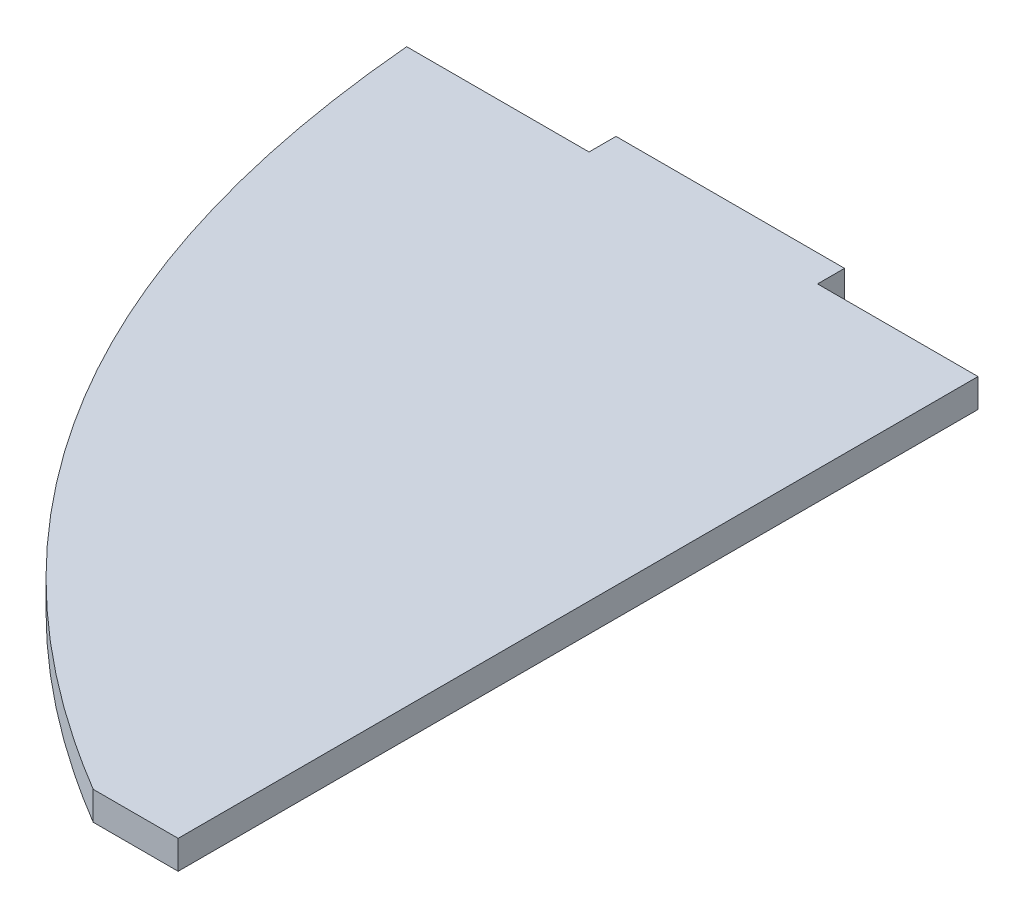
ISO-10303-21;
HEADER;
FILE_DESCRIPTION(('STEP AP214'),'2;1');
FILE_NAME('part.step','',(''),(''),'','','');
FILE_SCHEMA(('AUTOMOTIVE_DESIGN { 1 0 10303 214 1 1 1 1 }'));
ENDSEC;
DATA;
#1=APPLICATION_CONTEXT('core data for automotive mechanical design processes');
#2=APPLICATION_PROTOCOL_DEFINITION('international standard','automotive_design',2000,#1);
#3=PRODUCT_CONTEXT('',#1,'mechanical');
#4=PRODUCT('Part','Part','',(#3));
#5=PRODUCT_RELATED_PRODUCT_CATEGORY('part','',(#4));
#6=PRODUCT_DEFINITION_FORMATION('','',#4);
#7=PRODUCT_DEFINITION_CONTEXT('part definition',#1,'design');
#8=PRODUCT_DEFINITION('design','',#6,#7);
#9=PRODUCT_DEFINITION_SHAPE('','',#8);
#10=(LENGTH_UNIT() NAMED_UNIT(*) SI_UNIT(.MILLI.,.METRE.));
#11=(NAMED_UNIT(*) PLANE_ANGLE_UNIT() SI_UNIT($,.RADIAN.));
#12=(NAMED_UNIT(*) SI_UNIT($,.STERADIAN.) SOLID_ANGLE_UNIT());
#13=UNCERTAINTY_MEASURE_WITH_UNIT(LENGTH_MEASURE(1.E-05),#10,'distance_accuracy_value','');
#14=(GEOMETRIC_REPRESENTATION_CONTEXT(3) GLOBAL_UNCERTAINTY_ASSIGNED_CONTEXT((#13)) GLOBAL_UNIT_ASSIGNED_CONTEXT((#10,
#11,#12)) REPRESENTATION_CONTEXT('',''));
#15=CARTESIAN_POINT('',(0.,0.,0.));
#16=DIRECTION('',(0.,0.,1.));
#17=DIRECTION('',(1.,0.,0.));
#18=AXIS2_PLACEMENT_3D('',#15,#16,#17);
#19=CARTESIAN_POINT('',(36.7862068965517,-3.175,0.));
#20=DIRECTION('',(1.,0.,0.));
#21=DIRECTION('',(0.,0.,-1.));
#22=AXIS2_PLACEMENT_3D('',#19,#20,#21);
#23=PLANE('',#22);
#24=DIRECTION('',(0.,0.,-1.));
#25=VECTOR('',#24,1.);
#26=CARTESIAN_POINT('',(36.7862068965517,0.,0.));
#27=LINE('',#26,#25);
#28=CARTESIAN_POINT('',(36.7862068965517,0.,88.9));
#29=VERTEX_POINT('',#28);
#30=CARTESIAN_POINT('',(36.7862068965517,0.,0.));
#31=VERTEX_POINT('',#30);
#32=EDGE_CURVE('E167',#29,#31,#27,.T.);
#33=ORIENTED_EDGE('',*,*,#32,.F.);
#34=DIRECTION('',(0.,1.,0.));
#35=VECTOR('',#34,1.);
#36=CARTESIAN_POINT('',(36.7862068965517,-3.175,88.9));
#37=LINE('',#36,#35);
#38=CARTESIAN_POINT('',(36.7862068965517,-3.175,88.9));
#39=VERTEX_POINT('',#38);
#40=EDGE_CURVE('E11',#39,#29,#37,.T.);
#41=ORIENTED_EDGE('',*,*,#40,.F.);
#42=DIRECTION('',(0.,0.,-1.));
#43=VECTOR('',#42,1.);
#44=CARTESIAN_POINT('',(36.7862068965517,-3.175,0.));
#45=LINE('',#44,#43);
#46=CARTESIAN_POINT('',(36.7862068965517,-3.175,0.));
#47=VERTEX_POINT('',#46);
#48=EDGE_CURVE('E173',#39,#47,#45,.T.);
#49=ORIENTED_EDGE('',*,*,#48,.T.);
#50=DIRECTION('',(0.,1.,0.));
#51=VECTOR('',#50,1.);
#52=CARTESIAN_POINT('',(36.7862068965517,-3.175,0.));
#53=LINE('',#52,#51);
#54=EDGE_CURVE('E36',#47,#31,#53,.T.);
#55=ORIENTED_EDGE('',*,*,#54,.T.);
#56=EDGE_LOOP('',(#33,#41,#49,#55));
#57=FACE_BOUND('',#56,.T.);
#58=ADVANCED_FACE('F33',(#57),#23,.T.);
#59=CARTESIAN_POINT('',(27.3468454787862,-3.175,88.9));
#60=DIRECTION('',(0.,0.,1.));
#61=DIRECTION('',(1.,0.,0.));
#62=AXIS2_PLACEMENT_3D('',#59,#60,#61);
#63=PLANE('',#62);
#64=DIRECTION('',(1.,0.,0.));
#65=VECTOR('',#64,1.);
#66=CARTESIAN_POINT('',(27.3468454787862,0.,88.9));
#67=LINE('',#66,#65);
#68=CARTESIAN_POINT('',(27.3468454787862,0.,88.9));
#69=VERTEX_POINT('',#68);
#70=EDGE_CURVE('E172',#69,#29,#67,.T.);
#71=ORIENTED_EDGE('',*,*,#70,.F.);
#72=DIRECTION('',(0.,1.,0.));
#73=VECTOR('',#72,1.);
#74=CARTESIAN_POINT('',(27.3468454787862,-3.175,88.9));
#75=LINE('',#74,#73);
#76=CARTESIAN_POINT('',(27.3468454787862,-3.175,88.9));
#77=VERTEX_POINT('',#76);
#78=EDGE_CURVE('E42',#77,#69,#75,.T.);
#79=ORIENTED_EDGE('',*,*,#78,.F.);
#80=DIRECTION('',(1.,0.,0.));
#81=VECTOR('',#80,1.);
#82=CARTESIAN_POINT('',(27.3468454787862,-3.175,88.9));
#83=LINE('',#82,#81);
#84=EDGE_CURVE('E120',#77,#39,#83,.T.);
#85=ORIENTED_EDGE('',*,*,#84,.T.);
#86=ORIENTED_EDGE('',*,*,#40,.T.);
#87=EDGE_LOOP('',(#71,#79,#85,#86));
#88=FACE_BOUND('',#87,.T.);
#89=ADVANCED_FACE('F140',(#88),#63,.T.);
#90=CARTESIAN_POINT('',(-26.7137931034483,-3.175,0.));
#91=CARTESIAN_POINT('',(-21.5349823293348,-3.175,59.7712141157542));
#92=CARTESIAN_POINT('',(27.3468454787862,-3.175,88.9));
#93=B_SPLINE_CURVE_WITH_KNOTS('',2,(#90,#91,#92),.UNSPECIFIED.,.F.,.F.,(3,3),(0.,1.),.UNSPECIFIED.);
#94=DIRECTION('',(0.,1.,0.));
#95=VECTOR('',#94,1.);
#96=SURFACE_OF_LINEAR_EXTRUSION('',#93,#95);
#97=CARTESIAN_POINT('',(-26.7137931034483,0.,0.));
#98=CARTESIAN_POINT('',(-21.5349823293348,0.,59.7712141157542));
#99=CARTESIAN_POINT('',(27.3468454787862,0.,88.9));
#100=B_SPLINE_CURVE_WITH_KNOTS('',2,(#97,#98,#99),.UNSPECIFIED.,.F.,.F.,(3,3),(0.,1.),.UNSPECIFIED.);
#101=CARTESIAN_POINT('',(-26.7137931034483,0.,0.));
#102=VERTEX_POINT('',#101);
#103=EDGE_CURVE('E107',#102,#69,#100,.T.);
#104=ORIENTED_EDGE('',*,*,#103,.F.);
#105=DIRECTION('',(0.,1.,0.));
#106=VECTOR('',#105,1.);
#107=CARTESIAN_POINT('',(-26.7137931034483,-3.175,0.));
#108=LINE('',#107,#106);
#109=CARTESIAN_POINT('',(-26.7137931034483,-3.175,0.));
#110=VERTEX_POINT('',#109);
#111=EDGE_CURVE('E102',#110,#102,#108,.T.);
#112=ORIENTED_EDGE('',*,*,#111,.F.);
#113=EDGE_CURVE('E105',#110,#77,#93,.T.);
#114=ORIENTED_EDGE('',*,*,#113,.T.);
#115=ORIENTED_EDGE('',*,*,#78,.T.);
#116=EDGE_LOOP('',(#104,#112,#114,#115));
#117=FACE_BOUND('',#116,.T.);
#118=ADVANCED_FACE('F104',(#117),#96,.T.);
#119=CARTESIAN_POINT('',(-6.44675427095429,-3.175,0.));
#120=DIRECTION('',(0.,0.,-1.));
#121=DIRECTION('',(-1.,0.,0.));
#122=AXIS2_PLACEMENT_3D('',#119,#120,#121);
#123=PLANE('',#122);
#124=DIRECTION('',(-1.,0.,0.));
#125=VECTOR('',#124,1.);
#126=CARTESIAN_POINT('',(-6.44675427095429,0.,0.));
#127=LINE('',#126,#125);
#128=CARTESIAN_POINT('',(-6.44675427095429,0.,0.));
#129=VERTEX_POINT('',#128);
#130=EDGE_CURVE('E177',#129,#102,#127,.T.);
#131=ORIENTED_EDGE('',*,*,#130,.F.);
#132=DIRECTION('',(0.,1.,0.));
#133=VECTOR('',#132,1.);
#134=CARTESIAN_POINT('',(-6.44675427095429,-3.175,0.));
#135=LINE('',#134,#133);
#136=CARTESIAN_POINT('',(-6.44675427095429,-3.175,0.));
#137=VERTEX_POINT('',#136);
#138=EDGE_CURVE('E112',#137,#129,#135,.T.);
#139=ORIENTED_EDGE('',*,*,#138,.F.);
#140=DIRECTION('',(-1.,0.,0.));
#141=VECTOR('',#140,1.);
#142=CARTESIAN_POINT('',(-6.44675427095429,-3.175,0.));
#143=LINE('',#142,#141);
#144=EDGE_CURVE('E118',#137,#110,#143,.T.);
#145=ORIENTED_EDGE('',*,*,#144,.T.);
#146=ORIENTED_EDGE('',*,*,#111,.T.);
#147=EDGE_LOOP('',(#131,#139,#145,#146));
#148=FACE_BOUND('',#147,.T.);
#149=ADVANCED_FACE('F122',(#148),#123,.T.);
#150=CARTESIAN_POINT('',(-6.44675427095429,-3.175,0.));
#151=DIRECTION('',(-1.,0.,0.));
#152=DIRECTION('',(0.,0.,1.));
#153=AXIS2_PLACEMENT_3D('',#150,#151,#152);
#154=PLANE('',#153);
#155=DIRECTION('',(0.,0.,1.));
#156=VECTOR('',#155,1.);
#157=CARTESIAN_POINT('',(-6.44675427095429,0.,0.));
#158=LINE('',#157,#156);
#159=CARTESIAN_POINT('',(-6.44675427095429,0.,-3.));
#160=VERTEX_POINT('',#159);
#161=EDGE_CURVE('E201',#160,#129,#158,.T.);
#162=ORIENTED_EDGE('',*,*,#161,.F.);
#163=DIRECTION('',(0.,1.,0.));
#164=VECTOR('',#163,1.);
#165=CARTESIAN_POINT('',(-6.44675427095429,-3.175,-3.));
#166=LINE('',#165,#164);
#167=CARTESIAN_POINT('',(-6.44675427095429,-3.175,-3.));
#168=VERTEX_POINT('',#167);
#169=EDGE_CURVE('E185',#168,#160,#166,.T.);
#170=ORIENTED_EDGE('',*,*,#169,.F.);
#171=DIRECTION('',(0.,0.,1.));
#172=VECTOR('',#171,1.);
#173=CARTESIAN_POINT('',(-6.44675427095429,-3.175,0.));
#174=LINE('',#173,#172);
#175=EDGE_CURVE('E123',#168,#137,#174,.T.);
#176=ORIENTED_EDGE('',*,*,#175,.T.);
#177=ORIENTED_EDGE('',*,*,#138,.T.);
#178=EDGE_LOOP('',(#162,#170,#176,#177));
#179=FACE_BOUND('',#178,.T.);
#180=ADVANCED_FACE('F144',(#179),#154,.T.);
#181=CARTESIAN_POINT('',(-6.44675427095429,-3.175,-3.));
#182=DIRECTION('',(0.,0.,-1.));
#183=DIRECTION('',(-1.,0.,0.));
#184=AXIS2_PLACEMENT_3D('',#181,#182,#183);
#185=PLANE('',#184);
#186=DIRECTION('',(-1.,0.,0.));
#187=VECTOR('',#186,1.);
#188=CARTESIAN_POINT('',(-6.44675427095429,0.,-3.));
#189=LINE('',#188,#187);
#190=CARTESIAN_POINT('',(18.9532457290457,0.,-2.99999999999999));
#191=VERTEX_POINT('',#190);
#192=EDGE_CURVE('E196',#191,#160,#189,.T.);
#193=ORIENTED_EDGE('',*,*,#192,.F.);
#194=DIRECTION('',(0.,1.,0.));
#195=VECTOR('',#194,1.);
#196=CARTESIAN_POINT('',(18.9532457290457,-3.175,-2.99999999999999));
#197=LINE('',#196,#195);
#198=CARTESIAN_POINT('',(18.9532457290457,-3.175,-2.99999999999999));
#199=VERTEX_POINT('',#198);
#200=EDGE_CURVE('E187',#199,#191,#197,.T.);
#201=ORIENTED_EDGE('',*,*,#200,.F.);
#202=DIRECTION('',(-1.,0.,0.));
#203=VECTOR('',#202,1.);
#204=CARTESIAN_POINT('',(-6.44675427095429,-3.175,-3.));
#205=LINE('',#204,#203);
#206=EDGE_CURVE('E125',#199,#168,#205,.T.);
#207=ORIENTED_EDGE('',*,*,#206,.T.);
#208=ORIENTED_EDGE('',*,*,#169,.T.);
#209=EDGE_LOOP('',(#193,#201,#207,#208));
#210=FACE_BOUND('',#209,.T.);
#211=ADVANCED_FACE('F147',(#210),#185,.T.);
#212=CARTESIAN_POINT('',(18.9532457290457,-3.175,-2.99999999999999));
#213=DIRECTION('',(1.,0.,0.));
#214=DIRECTION('',(0.,0.,-1.));
#215=AXIS2_PLACEMENT_3D('',#212,#213,#214);
#216=PLANE('',#215);
#217=DIRECTION('',(0.,0.,-1.));
#218=VECTOR('',#217,1.);
#219=CARTESIAN_POINT('',(18.9532457290457,0.,-2.99999999999999));
#220=LINE('',#219,#218);
#221=CARTESIAN_POINT('',(18.9532457290457,0.,0.));
#222=VERTEX_POINT('',#221);
#223=EDGE_CURVE('E193',#222,#191,#220,.T.);
#224=ORIENTED_EDGE('',*,*,#223,.F.);
#225=DIRECTION('',(0.,1.,0.));
#226=VECTOR('',#225,1.);
#227=CARTESIAN_POINT('',(18.9532457290457,-3.175,0.));
#228=LINE('',#227,#226);
#229=CARTESIAN_POINT('',(18.9532457290457,-3.175,0.));
#230=VERTEX_POINT('',#229);
#231=EDGE_CURVE('E188',#230,#222,#228,.T.);
#232=ORIENTED_EDGE('',*,*,#231,.F.);
#233=DIRECTION('',(0.,0.,-1.));
#234=VECTOR('',#233,1.);
#235=CARTESIAN_POINT('',(18.9532457290457,-3.175,-2.99999999999999));
#236=LINE('',#235,#234);
#237=EDGE_CURVE('E206',#230,#199,#236,.T.);
#238=ORIENTED_EDGE('',*,*,#237,.T.);
#239=ORIENTED_EDGE('',*,*,#200,.T.);
#240=EDGE_LOOP('',(#224,#232,#238,#239));
#241=FACE_BOUND('',#240,.T.);
#242=ADVANCED_FACE('F151',(#241),#216,.T.);
#243=CARTESIAN_POINT('',(36.7862068965517,-3.175,0.));
#244=DIRECTION('',(0.,0.,-1.));
#245=DIRECTION('',(-1.,0.,0.));
#246=AXIS2_PLACEMENT_3D('',#243,#244,#245);
#247=PLANE('',#246);
#248=DIRECTION('',(-1.,0.,0.));
#249=VECTOR('',#248,1.);
#250=CARTESIAN_POINT('',(36.7862068965517,0.,0.));
#251=LINE('',#250,#249);
#252=EDGE_CURVE('E171',#31,#222,#251,.T.);
#253=ORIENTED_EDGE('',*,*,#252,.F.);
#254=ORIENTED_EDGE('',*,*,#54,.F.);
#255=DIRECTION('',(-1.,0.,0.));
#256=VECTOR('',#255,1.);
#257=CARTESIAN_POINT('',(36.7862068965517,-3.175,0.));
#258=LINE('',#257,#256);
#259=EDGE_CURVE('E175',#47,#230,#258,.T.);
#260=ORIENTED_EDGE('',*,*,#259,.T.);
#261=ORIENTED_EDGE('',*,*,#231,.T.);
#262=EDGE_LOOP('',(#253,#254,#260,#261));
#263=FACE_BOUND('',#262,.T.);
#264=ADVANCED_FACE('F154',(#263),#247,.T.);
#265=CARTESIAN_POINT('',(-10.6092280708329,-3.175,52.1106070578771));
#266=DIRECTION('',(0.,1.,0.));
#267=DIRECTION('',(0.,0.,1.));
#268=AXIS2_PLACEMENT_3D('',#265,#266,#267);
#269=PLANE('',#268);
#270=ORIENTED_EDGE('',*,*,#48,.F.);
#271=ORIENTED_EDGE('',*,*,#84,.F.);
#272=ORIENTED_EDGE('',*,*,#113,.F.);
#273=ORIENTED_EDGE('',*,*,#144,.F.);
#274=ORIENTED_EDGE('',*,*,#175,.F.);
#275=ORIENTED_EDGE('',*,*,#206,.F.);
#276=ORIENTED_EDGE('',*,*,#237,.F.);
#277=ORIENTED_EDGE('',*,*,#259,.F.);
#278=EDGE_LOOP('',(#270,#271,#272,#273,#274,#275,#276,#277));
#279=FACE_BOUND('',#278,.T.);
#280=ADVANCED_FACE('F116',(#279),#269,.F.);
#281=CARTESIAN_POINT('',(-10.6092280708329,0.,52.1106070578771));
#282=DIRECTION('',(0.,1.,0.));
#283=DIRECTION('',(0.,0.,1.));
#284=AXIS2_PLACEMENT_3D('',#281,#282,#283);
#285=PLANE('',#284);
#286=ORIENTED_EDGE('',*,*,#32,.T.);
#287=ORIENTED_EDGE('',*,*,#252,.T.);
#288=ORIENTED_EDGE('',*,*,#223,.T.);
#289=ORIENTED_EDGE('',*,*,#192,.T.);
#290=ORIENTED_EDGE('',*,*,#161,.T.);
#291=ORIENTED_EDGE('',*,*,#130,.T.);
#292=ORIENTED_EDGE('',*,*,#103,.T.);
#293=ORIENTED_EDGE('',*,*,#70,.T.);
#294=EDGE_LOOP('',(#286,#287,#288,#289,#290,#291,#292,#293));
#295=FACE_BOUND('',#294,.T.);
#296=ADVANCED_FACE('F160',(#295),#285,.T.);
#297=CLOSED_SHELL('',(#58,#89,#118,#149,#180,#211,#242,#264,#280,#296));
#298=MANIFOLD_SOLID_BREP('B2',#297);
#299=ADVANCED_BREP_SHAPE_REPRESENTATION('',(#18,#298),#14);
#300=SHAPE_DEFINITION_REPRESENTATION(#9,#299);
ENDSEC;
END-ISO-10303-21;
